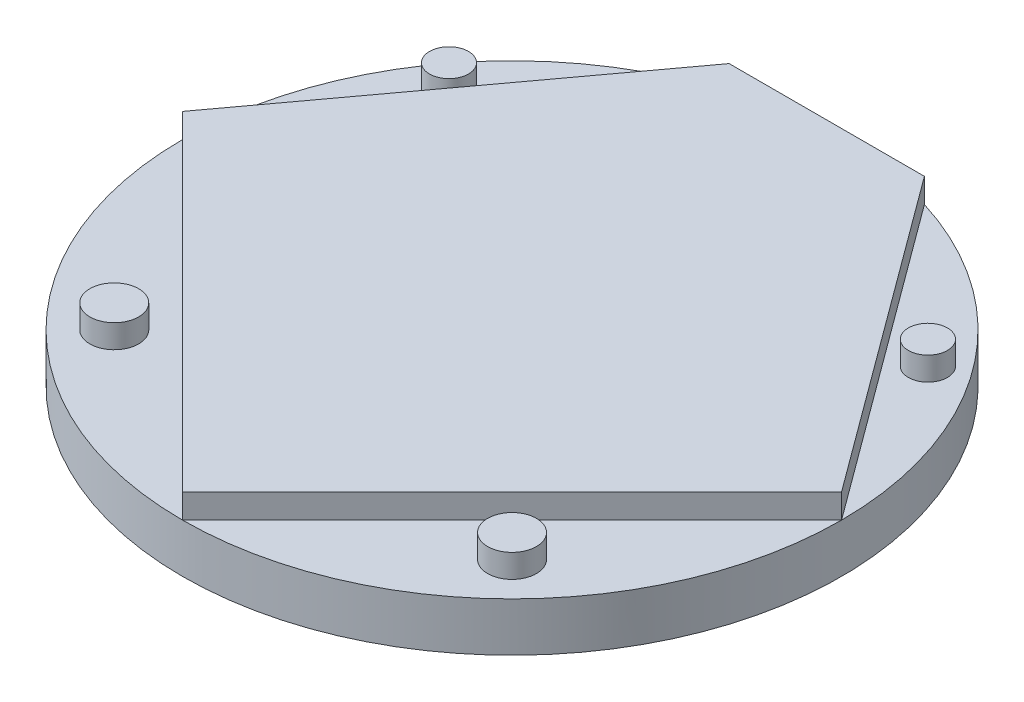
ISO-10303-21;
HEADER;
FILE_DESCRIPTION(('STEP AP214'),'2;1');
FILE_NAME('part.step','',(''),(''),'','','');
FILE_SCHEMA(('AUTOMOTIVE_DESIGN { 1 0 10303 214 1 1 1 1 }'));
ENDSEC;
DATA;
#1=APPLICATION_CONTEXT('core data for automotive mechanical design processes');
#2=APPLICATION_PROTOCOL_DEFINITION('international standard','automotive_design',2000,#1);
#3=PRODUCT_CONTEXT('',#1,'mechanical');
#4=PRODUCT('Part','Part','',(#3));
#5=PRODUCT_RELATED_PRODUCT_CATEGORY('part','',(#4));
#6=PRODUCT_DEFINITION_FORMATION('','',#4);
#7=PRODUCT_DEFINITION_CONTEXT('part definition',#1,'design');
#8=PRODUCT_DEFINITION('design','',#6,#7);
#9=PRODUCT_DEFINITION_SHAPE('','',#8);
#10=(LENGTH_UNIT() NAMED_UNIT(*) SI_UNIT(.MILLI.,.METRE.));
#11=(NAMED_UNIT(*) PLANE_ANGLE_UNIT() SI_UNIT($,.RADIAN.));
#12=(NAMED_UNIT(*) SI_UNIT($,.STERADIAN.) SOLID_ANGLE_UNIT());
#13=UNCERTAINTY_MEASURE_WITH_UNIT(LENGTH_MEASURE(1.E-05),#10,'distance_accuracy_value','');
#14=(GEOMETRIC_REPRESENTATION_CONTEXT(3) GLOBAL_UNCERTAINTY_ASSIGNED_CONTEXT((#13)) GLOBAL_UNIT_ASSIGNED_CONTEXT((#10,
#11,#12)) REPRESENTATION_CONTEXT('',''));
#15=CARTESIAN_POINT('',(0.,0.,0.));
#16=DIRECTION('',(0.,0.,1.));
#17=DIRECTION('',(1.,0.,0.));
#18=AXIS2_PLACEMENT_3D('',#15,#16,#17);
#19=CARTESIAN_POINT('',(0.,12.7,0.));
#20=DIRECTION('',(0.,1.,0.));
#21=DIRECTION('',(0.,0.,1.));
#22=AXIS2_PLACEMENT_3D('',#19,#20,#21);
#23=PLANE('',#22);
#24=CARTESIAN_POINT('',(-51.7396144086084,12.7,51.7396144086084));
#25=DIRECTION('',(0.,1.,0.));
#26=DIRECTION('',(0.,0.,1.));
#27=AXIS2_PLACEMENT_3D('',#24,#25,#26);
#28=CIRCLE('',#27,6.35);
#29=CARTESIAN_POINT('',(-51.7396144086084,12.7,58.0896144086084));
#30=VERTEX_POINT('',#29);
#31=EDGE_CURVE('E133',#30,#30,#28,.T.);
#32=ORIENTED_EDGE('',*,*,#31,.F.);
#33=EDGE_LOOP('',(#32));
#34=FACE_BOUND('',#33,.T.);
#35=DIRECTION('',(0.707106781186548,0.,0.707106781186548));
#36=VECTOR('',#35,1.);
#37=CARTESIAN_POINT('',(-85.725,12.7,0.));
#38=LINE('',#37,#36);
#39=CARTESIAN_POINT('',(-85.725,12.7,0.));
#40=VERTEX_POINT('',#39);
#41=CARTESIAN_POINT('',(0.,12.7,85.725));
#42=VERTEX_POINT('',#41);
#43=EDGE_CURVE('E50',#40,#42,#38,.T.);
#44=ORIENTED_EDGE('',*,*,#43,.F.);
#45=CARTESIAN_POINT('',(0.,12.7,0.));
#46=DIRECTION('',(0.,1.,0.));
#47=DIRECTION('',(0.,0.,1.));
#48=AXIS2_PLACEMENT_3D('',#45,#46,#47);
#49=CIRCLE('',#48,85.725);
#50=EDGE_CURVE('E44',#40,#42,#49,.T.);
#51=ORIENTED_EDGE('',*,*,#50,.T.);
#52=EDGE_LOOP('',(#44,#51));
#53=FACE_BOUND('',#52,.T.);
#54=ADVANCED_FACE('F34',(#34,#53),#23,.T.);
#55=CARTESIAN_POINT('',(-62.2888408768636,12.7,-45.8936952588359));
#56=DIRECTION('',(0.,1.,0.));
#57=DIRECTION('',(0.,0.,1.));
#58=AXIS2_PLACEMENT_3D('',#55,#56,#57);
#59=CIRCLE('',#58,5.08000000000001);
#60=CARTESIAN_POINT('',(-62.2888408768636,12.7,-40.8136952588359));
#61=VERTEX_POINT('',#60);
#62=EDGE_CURVE('E151',#61,#61,#59,.T.);
#63=ORIENTED_EDGE('',*,*,#62,.F.);
#64=EDGE_LOOP('',(#63));
#65=FACE_BOUND('',#64,.T.);
#66=DIRECTION('',(-0.593171014001739,0.,0.805076485899413));
#67=VECTOR('',#66,1.);
#68=CARTESIAN_POINT('',(-25.4,12.7,-81.8756106847454));
#69=LINE('',#68,#67);
#70=CARTESIAN_POINT('',(-25.4,12.7,-81.8756106847454));
#71=VERTEX_POINT('',#70);
#72=EDGE_CURVE('E57',#71,#40,#69,.T.);
#73=ORIENTED_EDGE('',*,*,#72,.F.);
#74=EDGE_CURVE('E202',#71,#40,#49,.T.);
#75=ORIENTED_EDGE('',*,*,#74,.T.);
#76=EDGE_LOOP('',(#73,#75));
#77=FACE_BOUND('',#76,.T.);
#78=ADVANCED_FACE('F166',(#65,#77),#23,.T.);
#79=DIRECTION('',(-1.,0.,0.));
#80=VECTOR('',#79,1.);
#81=CARTESIAN_POINT('',(-25.4,12.7,-81.8756106847454));
#82=LINE('',#81,#80);
#83=CARTESIAN_POINT('',(25.4,12.7,-81.8756106847454));
#84=VERTEX_POINT('',#83);
#85=EDGE_CURVE('E119',#84,#71,#82,.T.);
#86=ORIENTED_EDGE('',*,*,#85,.F.);
#87=EDGE_CURVE('E203',#84,#71,#49,.T.);
#88=ORIENTED_EDGE('',*,*,#87,.T.);
#89=EDGE_LOOP('',(#86,#88));
#90=FACE_BOUND('',#89,.T.);
#91=ADVANCED_FACE('F168',(#90),#23,.T.);
#92=CARTESIAN_POINT('',(62.2888408768636,12.7,-45.8936952588359));
#93=DIRECTION('',(0.,1.,0.));
#94=DIRECTION('',(0.,0.,1.));
#95=AXIS2_PLACEMENT_3D('',#92,#93,#94);
#96=CIRCLE('',#95,5.08000000000001);
#97=CARTESIAN_POINT('',(62.2888408768636,12.7,-40.8136952588359));
#98=VERTEX_POINT('',#97);
#99=EDGE_CURVE('E145',#98,#98,#96,.T.);
#100=ORIENTED_EDGE('',*,*,#99,.F.);
#101=EDGE_LOOP('',(#100));
#102=FACE_BOUND('',#101,.T.);
#103=DIRECTION('',(-0.593171014001739,0.,-0.805076485899413));
#104=VECTOR('',#103,1.);
#105=CARTESIAN_POINT('',(85.725,12.7,0.));
#106=LINE('',#105,#104);
#107=CARTESIAN_POINT('',(85.725,12.7,0.));
#108=VERTEX_POINT('',#107);
#109=EDGE_CURVE('E122',#108,#84,#106,.T.);
#110=ORIENTED_EDGE('',*,*,#109,.F.);
#111=EDGE_CURVE('E43',#108,#84,#49,.T.);
#112=ORIENTED_EDGE('',*,*,#111,.T.);
#113=EDGE_LOOP('',(#110,#112));
#114=FACE_BOUND('',#113,.T.);
#115=ADVANCED_FACE('F174',(#102,#114),#23,.T.);
#116=CARTESIAN_POINT('',(0.,12.7,0.));
#117=DIRECTION('',(0.,-1.,0.));
#118=DIRECTION('',(0.,0.,-1.));
#119=AXIS2_PLACEMENT_3D('',#116,#117,#118);
#120=CYLINDRICAL_SURFACE('',#119,85.725);
#121=EDGE_CURVE('E11',#42,#108,#49,.T.);
#122=ORIENTED_EDGE('',*,*,#121,.F.);
#123=ORIENTED_EDGE('',*,*,#50,.F.);
#124=ORIENTED_EDGE('',*,*,#74,.F.);
#125=ORIENTED_EDGE('',*,*,#87,.F.);
#126=ORIENTED_EDGE('',*,*,#111,.F.);
#127=EDGE_LOOP('',(#122,#123,#124,#125,#126));
#128=FACE_BOUND('',#127,.T.);
#129=CARTESIAN_POINT('',(0.,0.,0.));
#130=DIRECTION('',(0.,1.,0.));
#131=DIRECTION('',(0.,0.,1.));
#132=AXIS2_PLACEMENT_3D('',#129,#130,#131);
#133=CIRCLE('',#132,85.725);
#134=CARTESIAN_POINT('',(0.,0.,85.725));
#135=VERTEX_POINT('',#134);
#136=EDGE_CURVE('E38',#135,#135,#133,.T.);
#137=ORIENTED_EDGE('',*,*,#136,.T.);
#138=EDGE_LOOP('',(#137));
#139=FACE_BOUND('',#138,.T.);
#140=ADVANCED_FACE('F36',(#128,#139),#120,.T.);
#141=CARTESIAN_POINT('',(51.7396144086084,12.7,51.7396144086084));
#142=DIRECTION('',(0.,1.,0.));
#143=DIRECTION('',(0.,0.,1.));
#144=AXIS2_PLACEMENT_3D('',#141,#142,#143);
#145=CIRCLE('',#144,6.35);
#146=CARTESIAN_POINT('',(51.7396144086084,12.7,58.0896144086084));
#147=VERTEX_POINT('',#146);
#148=EDGE_CURVE('E139',#147,#147,#145,.T.);
#149=ORIENTED_EDGE('',*,*,#148,.F.);
#150=EDGE_LOOP('',(#149));
#151=FACE_BOUND('',#150,.T.);
#152=DIRECTION('',(0.707106781186548,0.,-0.707106781186548));
#153=VECTOR('',#152,1.);
#154=CARTESIAN_POINT('',(0.,12.7,85.725));
#155=LINE('',#154,#153);
#156=EDGE_CURVE('E125',#42,#108,#155,.T.);
#157=ORIENTED_EDGE('',*,*,#156,.F.);
#158=ORIENTED_EDGE('',*,*,#121,.T.);
#159=EDGE_LOOP('',(#157,#158));
#160=FACE_BOUND('',#159,.T.);
#161=ADVANCED_FACE('F177',(#151,#160),#23,.T.);
#162=CARTESIAN_POINT('',(0.,0.,0.));
#163=DIRECTION('',(0.,1.,0.));
#164=DIRECTION('',(0.,0.,1.));
#165=AXIS2_PLACEMENT_3D('',#162,#163,#164);
#166=PLANE('',#165);
#167=ORIENTED_EDGE('',*,*,#136,.F.);
#168=EDGE_LOOP('',(#167));
#169=FACE_BOUND('',#168,.T.);
#170=ADVANCED_FACE('F180',(#169),#166,.F.);
#171=CARTESIAN_POINT('',(-85.725,19.05,0.));
#172=DIRECTION('',(0.707106781186548,0.,-0.707106781186548));
#173=DIRECTION('',(-0.707106781186548,0.,-0.707106781186548));
#174=AXIS2_PLACEMENT_3D('',#171,#172,#173);
#175=PLANE('',#174);
#176=ORIENTED_EDGE('',*,*,#43,.T.);
#177=DIRECTION('',(0.,-1.,0.));
#178=VECTOR('',#177,1.);
#179=CARTESIAN_POINT('',(0.,19.05,85.725));
#180=LINE('',#179,#178);
#181=CARTESIAN_POINT('',(0.,19.05,85.725));
#182=VERTEX_POINT('',#181);
#183=EDGE_CURVE('E89',#182,#42,#180,.T.);
#184=ORIENTED_EDGE('',*,*,#183,.F.);
#185=DIRECTION('',(0.707106781186548,0.,0.707106781186548));
#186=VECTOR('',#185,1.);
#187=CARTESIAN_POINT('',(-85.725,19.05,0.));
#188=LINE('',#187,#186);
#189=CARTESIAN_POINT('',(-85.725,19.05,0.));
#190=VERTEX_POINT('',#189);
#191=EDGE_CURVE('E95',#190,#182,#188,.T.);
#192=ORIENTED_EDGE('',*,*,#191,.F.);
#193=DIRECTION('',(0.,-1.,0.));
#194=VECTOR('',#193,1.);
#195=CARTESIAN_POINT('',(-85.725,19.05,0.));
#196=LINE('',#195,#194);
#197=EDGE_CURVE('E116',#190,#40,#196,.T.);
#198=ORIENTED_EDGE('',*,*,#197,.T.);
#199=EDGE_LOOP('',(#176,#184,#192,#198));
#200=FACE_BOUND('',#199,.T.);
#201=ADVANCED_FACE('F105',(#200),#175,.F.);
#202=CARTESIAN_POINT('',(0.,19.05,85.725));
#203=DIRECTION('',(-0.707106781186548,0.,-0.707106781186548));
#204=DIRECTION('',(-0.707106781186548,0.,0.707106781186548));
#205=AXIS2_PLACEMENT_3D('',#202,#203,#204);
#206=PLANE('',#205);
#207=ORIENTED_EDGE('',*,*,#156,.T.);
#208=DIRECTION('',(0.,-1.,0.));
#209=VECTOR('',#208,1.);
#210=CARTESIAN_POINT('',(85.725,19.05,0.));
#211=LINE('',#210,#209);
#212=CARTESIAN_POINT('',(85.725,19.05,0.));
#213=VERTEX_POINT('',#212);
#214=EDGE_CURVE('E91',#213,#108,#211,.T.);
#215=ORIENTED_EDGE('',*,*,#214,.F.);
#216=DIRECTION('',(0.707106781186548,0.,-0.707106781186548));
#217=VECTOR('',#216,1.);
#218=CARTESIAN_POINT('',(0.,19.05,85.725));
#219=LINE('',#218,#217);
#220=EDGE_CURVE('E84',#182,#213,#219,.T.);
#221=ORIENTED_EDGE('',*,*,#220,.F.);
#222=ORIENTED_EDGE('',*,*,#183,.T.);
#223=EDGE_LOOP('',(#207,#215,#221,#222));
#224=FACE_BOUND('',#223,.T.);
#225=ADVANCED_FACE('F87',(#224),#206,.F.);
#226=CARTESIAN_POINT('',(85.725,19.05,0.));
#227=DIRECTION('',(-0.805076485899413,0.,0.593171014001739));
#228=DIRECTION('',(0.59317101400174,0.,0.805076485899413));
#229=AXIS2_PLACEMENT_3D('',#226,#227,#228);
#230=PLANE('',#229);
#231=ORIENTED_EDGE('',*,*,#109,.T.);
#232=DIRECTION('',(0.,-1.,0.));
#233=VECTOR('',#232,1.);
#234=CARTESIAN_POINT('',(25.4,19.05,-81.8756106847454));
#235=LINE('',#234,#233);
#236=CARTESIAN_POINT('',(25.4,19.05,-81.8756106847454));
#237=VERTEX_POINT('',#236);
#238=EDGE_CURVE('E108',#237,#84,#235,.T.);
#239=ORIENTED_EDGE('',*,*,#238,.F.);
#240=DIRECTION('',(-0.593171014001739,0.,-0.805076485899413));
#241=VECTOR('',#240,1.);
#242=CARTESIAN_POINT('',(85.725,19.05,0.));
#243=LINE('',#242,#241);
#244=EDGE_CURVE('E94',#213,#237,#243,.T.);
#245=ORIENTED_EDGE('',*,*,#244,.F.);
#246=ORIENTED_EDGE('',*,*,#214,.T.);
#247=EDGE_LOOP('',(#231,#239,#245,#246));
#248=FACE_BOUND('',#247,.T.);
#249=ADVANCED_FACE('F208',(#248),#230,.F.);
#250=CARTESIAN_POINT('',(-25.4,19.05,-81.8756106847454));
#251=DIRECTION('',(0.,0.,1.));
#252=DIRECTION('',(1.,0.,0.));
#253=AXIS2_PLACEMENT_3D('',#250,#251,#252);
#254=PLANE('',#253);
#255=ORIENTED_EDGE('',*,*,#85,.T.);
#256=DIRECTION('',(0.,-1.,0.));
#257=VECTOR('',#256,1.);
#258=CARTESIAN_POINT('',(-25.4,19.05,-81.8756106847454));
#259=LINE('',#258,#257);
#260=CARTESIAN_POINT('',(-25.4,19.05,-81.8756106847454));
#261=VERTEX_POINT('',#260);
#262=EDGE_CURVE('E113',#261,#71,#259,.T.);
#263=ORIENTED_EDGE('',*,*,#262,.F.);
#264=DIRECTION('',(-1.,0.,0.));
#265=VECTOR('',#264,1.);
#266=CARTESIAN_POINT('',(-25.4,19.05,-81.8756106847454));
#267=LINE('',#266,#265);
#268=EDGE_CURVE('E130',#237,#261,#267,.T.);
#269=ORIENTED_EDGE('',*,*,#268,.F.);
#270=ORIENTED_EDGE('',*,*,#238,.T.);
#271=EDGE_LOOP('',(#255,#263,#269,#270));
#272=FACE_BOUND('',#271,.T.);
#273=ADVANCED_FACE('F211',(#272),#254,.F.);
#274=CARTESIAN_POINT('',(-25.4,19.05,-81.8756106847454));
#275=DIRECTION('',(0.805076485899413,0.,0.593171014001739));
#276=DIRECTION('',(0.59317101400174,0.,-0.805076485899413));
#277=AXIS2_PLACEMENT_3D('',#274,#275,#276);
#278=PLANE('',#277);
#279=ORIENTED_EDGE('',*,*,#72,.T.);
#280=ORIENTED_EDGE('',*,*,#197,.F.);
#281=DIRECTION('',(-0.593171014001739,0.,0.805076485899413));
#282=VECTOR('',#281,1.);
#283=CARTESIAN_POINT('',(-25.4,19.05,-81.8756106847454));
#284=LINE('',#283,#282);
#285=EDGE_CURVE('E100',#261,#190,#284,.T.);
#286=ORIENTED_EDGE('',*,*,#285,.F.);
#287=ORIENTED_EDGE('',*,*,#262,.T.);
#288=EDGE_LOOP('',(#279,#280,#286,#287));
#289=FACE_BOUND('',#288,.T.);
#290=ADVANCED_FACE('F214',(#289),#278,.F.);
#291=CARTESIAN_POINT('',(0.,19.05,0.));
#292=DIRECTION('',(0.,1.,0.));
#293=DIRECTION('',(0.,0.,1.));
#294=AXIS2_PLACEMENT_3D('',#291,#292,#293);
#295=PLANE('',#294);
#296=ORIENTED_EDGE('',*,*,#191,.T.);
#297=ORIENTED_EDGE('',*,*,#220,.T.);
#298=ORIENTED_EDGE('',*,*,#244,.T.);
#299=ORIENTED_EDGE('',*,*,#268,.T.);
#300=ORIENTED_EDGE('',*,*,#285,.T.);
#301=EDGE_LOOP('',(#296,#297,#298,#299,#300));
#302=FACE_BOUND('',#301,.T.);
#303=ADVANCED_FACE('F98',(#302),#295,.T.);
#304=CARTESIAN_POINT('',(-51.7396144086084,18.796,51.7396144086084));
#305=DIRECTION('',(0.,-1.,0.));
#306=DIRECTION('',(0.,0.,-1.));
#307=AXIS2_PLACEMENT_3D('',#304,#305,#306);
#308=CYLINDRICAL_SURFACE('',#307,6.35);
#309=CARTESIAN_POINT('',(-51.7396144086084,18.796,51.7396144086084));
#310=DIRECTION('',(0.,1.,0.));
#311=DIRECTION('',(0.,0.,1.));
#312=AXIS2_PLACEMENT_3D('',#309,#310,#311);
#313=CIRCLE('',#312,6.35);
#314=CARTESIAN_POINT('',(-51.7396144086084,18.796,58.0896144086084));
#315=VERTEX_POINT('',#314);
#316=EDGE_CURVE('E128',#315,#315,#313,.T.);
#317=ORIENTED_EDGE('',*,*,#316,.F.);
#318=EDGE_LOOP('',(#317));
#319=FACE_BOUND('',#318,.T.);
#320=ORIENTED_EDGE('',*,*,#31,.T.);
#321=EDGE_LOOP('',(#320));
#322=FACE_BOUND('',#321,.T.);
#323=ADVANCED_FACE('F221',(#319,#322),#308,.T.);
#324=CARTESIAN_POINT('',(-51.7396144086084,18.796,51.7396144086084));
#325=DIRECTION('',(0.,1.,0.));
#326=DIRECTION('',(0.,0.,1.));
#327=AXIS2_PLACEMENT_3D('',#324,#325,#326);
#328=PLANE('',#327);
#329=ORIENTED_EDGE('',*,*,#316,.T.);
#330=EDGE_LOOP('',(#329));
#331=FACE_BOUND('',#330,.T.);
#332=ADVANCED_FACE('F285',(#331),#328,.T.);
#333=CARTESIAN_POINT('',(51.7396144086084,18.796,51.7396144086084));
#334=DIRECTION('',(0.,-1.,0.));
#335=DIRECTION('',(0.,0.,-1.));
#336=AXIS2_PLACEMENT_3D('',#333,#334,#335);
#337=CYLINDRICAL_SURFACE('',#336,6.35);
#338=CARTESIAN_POINT('',(51.7396144086084,18.796,51.7396144086084));
#339=DIRECTION('',(0.,1.,0.));
#340=DIRECTION('',(0.,0.,1.));
#341=AXIS2_PLACEMENT_3D('',#338,#339,#340);
#342=CIRCLE('',#341,6.35);
#343=CARTESIAN_POINT('',(51.7396144086084,18.796,58.0896144086084));
#344=VERTEX_POINT('',#343);
#345=EDGE_CURVE('E136',#344,#344,#342,.T.);
#346=ORIENTED_EDGE('',*,*,#345,.F.);
#347=EDGE_LOOP('',(#346));
#348=FACE_BOUND('',#347,.T.);
#349=ORIENTED_EDGE('',*,*,#148,.T.);
#350=EDGE_LOOP('',(#349));
#351=FACE_BOUND('',#350,.T.);
#352=ADVANCED_FACE('F294',(#348,#351),#337,.T.);
#353=CARTESIAN_POINT('',(51.7396144086084,18.796,51.7396144086084));
#354=DIRECTION('',(0.,1.,0.));
#355=DIRECTION('',(0.,0.,1.));
#356=AXIS2_PLACEMENT_3D('',#353,#354,#355);
#357=PLANE('',#356);
#358=ORIENTED_EDGE('',*,*,#345,.T.);
#359=EDGE_LOOP('',(#358));
#360=FACE_BOUND('',#359,.T.);
#361=ADVANCED_FACE('F304',(#360),#357,.T.);
#362=CARTESIAN_POINT('',(62.2888408768636,18.796,-45.8936952588359));
#363=DIRECTION('',(0.,-1.,0.));
#364=DIRECTION('',(0.,0.,-1.));
#365=AXIS2_PLACEMENT_3D('',#362,#363,#364);
#366=CYLINDRICAL_SURFACE('',#365,5.08000000000001);
#367=CARTESIAN_POINT('',(62.2888408768636,18.796,-45.8936952588359));
#368=DIRECTION('',(0.,1.,0.));
#369=DIRECTION('',(0.,0.,1.));
#370=AXIS2_PLACEMENT_3D('',#367,#368,#369);
#371=CIRCLE('',#370,5.08000000000001);
#372=CARTESIAN_POINT('',(62.2888408768636,18.796,-40.8136952588359));
#373=VERTEX_POINT('',#372);
#374=EDGE_CURVE('E142',#373,#373,#371,.T.);
#375=ORIENTED_EDGE('',*,*,#374,.F.);
#376=EDGE_LOOP('',(#375));
#377=FACE_BOUND('',#376,.T.);
#378=ORIENTED_EDGE('',*,*,#99,.T.);
#379=EDGE_LOOP('',(#378));
#380=FACE_BOUND('',#379,.T.);
#381=ADVANCED_FACE('F314',(#377,#380),#366,.T.);
#382=CARTESIAN_POINT('',(62.2888408768636,18.796,-45.8936952588359));
#383=DIRECTION('',(0.,1.,0.));
#384=DIRECTION('',(0.,0.,1.));
#385=AXIS2_PLACEMENT_3D('',#382,#383,#384);
#386=PLANE('',#385);
#387=ORIENTED_EDGE('',*,*,#374,.T.);
#388=EDGE_LOOP('',(#387));
#389=FACE_BOUND('',#388,.T.);
#390=ADVANCED_FACE('F162',(#389),#386,.T.);
#391=CARTESIAN_POINT('',(-62.2888408768636,18.796,-45.8936952588359));
#392=DIRECTION('',(0.,-1.,0.));
#393=DIRECTION('',(0.,0.,-1.));
#394=AXIS2_PLACEMENT_3D('',#391,#392,#393);
#395=CYLINDRICAL_SURFACE('',#394,5.08000000000001);
#396=CARTESIAN_POINT('',(-62.2888408768636,18.796,-45.8936952588359));
#397=DIRECTION('',(0.,1.,0.));
#398=DIRECTION('',(0.,0.,1.));
#399=AXIS2_PLACEMENT_3D('',#396,#397,#398);
#400=CIRCLE('',#399,5.08000000000001);
#401=CARTESIAN_POINT('',(-62.2888408768636,18.796,-40.8136952588359));
#402=VERTEX_POINT('',#401);
#403=EDGE_CURVE('E148',#402,#402,#400,.T.);
#404=ORIENTED_EDGE('',*,*,#403,.F.);
#405=EDGE_LOOP('',(#404));
#406=FACE_BOUND('',#405,.T.);
#407=ORIENTED_EDGE('',*,*,#62,.T.);
#408=EDGE_LOOP('',(#407));
#409=FACE_BOUND('',#408,.T.);
#410=ADVANCED_FACE('F159',(#406,#409),#395,.T.);
#411=CARTESIAN_POINT('',(-62.2888408768636,18.796,-45.8936952588359));
#412=DIRECTION('',(0.,1.,0.));
#413=DIRECTION('',(0.,0.,1.));
#414=AXIS2_PLACEMENT_3D('',#411,#412,#413);
#415=PLANE('',#414);
#416=ORIENTED_EDGE('',*,*,#403,.T.);
#417=EDGE_LOOP('',(#416));
#418=FACE_BOUND('',#417,.T.);
#419=ADVANCED_FACE('F157',(#418),#415,.T.);
#420=CLOSED_SHELL('',(#54,#78,#91,#115,#140,#161,#170,#201,#225,#249,#273,#290,#303,#323,#332,
#352,#361,#381,#390,#410,#419));
#421=MANIFOLD_SOLID_BREP('B2',#420);
#422=ADVANCED_BREP_SHAPE_REPRESENTATION('',(#18,#421),#14);
#423=SHAPE_DEFINITION_REPRESENTATION(#9,#422);
ENDSEC;
END-ISO-10303-21;
